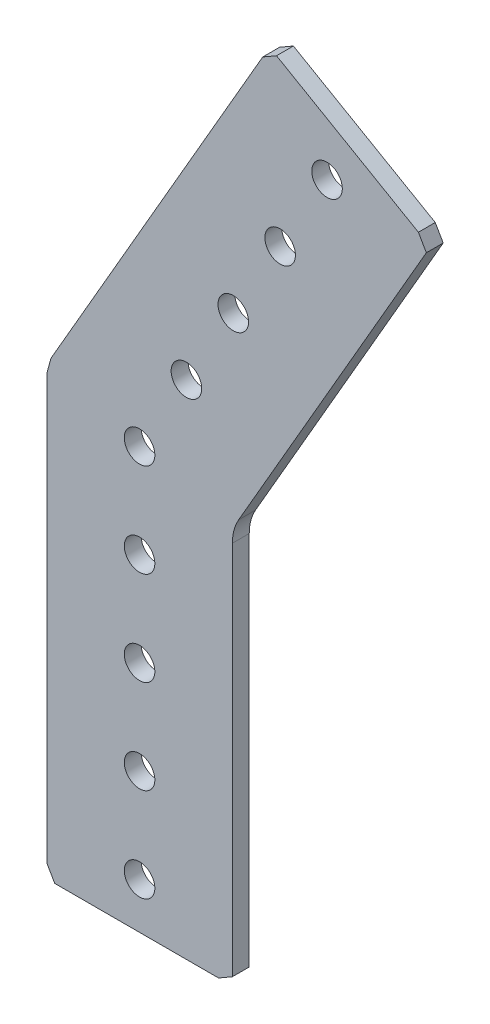
ISO-10303-21;
HEADER;
FILE_DESCRIPTION(('STEP AP214'),'2;1');
FILE_NAME('part.step','',(''),(''),'','','');
FILE_SCHEMA(('AUTOMOTIVE_DESIGN { 1 0 10303 214 1 1 1 1 }'));
ENDSEC;
DATA;
#1=APPLICATION_CONTEXT('core data for automotive mechanical design processes');
#2=APPLICATION_PROTOCOL_DEFINITION('international standard','automotive_design',2000,#1);
#3=PRODUCT_CONTEXT('',#1,'mechanical');
#4=PRODUCT('Part','Part','',(#3));
#5=PRODUCT_RELATED_PRODUCT_CATEGORY('part','',(#4));
#6=PRODUCT_DEFINITION_FORMATION('','',#4);
#7=PRODUCT_DEFINITION_CONTEXT('part definition',#1,'design');
#8=PRODUCT_DEFINITION('design','',#6,#7);
#9=PRODUCT_DEFINITION_SHAPE('','',#8);
#10=(LENGTH_UNIT() NAMED_UNIT(*) SI_UNIT(.MILLI.,.METRE.));
#11=(NAMED_UNIT(*) PLANE_ANGLE_UNIT() SI_UNIT($,.RADIAN.));
#12=(NAMED_UNIT(*) SI_UNIT($,.STERADIAN.) SOLID_ANGLE_UNIT());
#13=UNCERTAINTY_MEASURE_WITH_UNIT(LENGTH_MEASURE(1.E-05),#10,'distance_accuracy_value','');
#14=(GEOMETRIC_REPRESENTATION_CONTEXT(3) GLOBAL_UNCERTAINTY_ASSIGNED_CONTEXT((#13)) GLOBAL_UNIT_ASSIGNED_CONTEXT((#10,
#11,#12)) REPRESENTATION_CONTEXT('',''));
#15=CARTESIAN_POINT('',(0.,0.,0.));
#16=DIRECTION('',(0.,0.,1.));
#17=DIRECTION('',(1.,0.,0.));
#18=AXIS2_PLACEMENT_3D('',#15,#16,#17);
#19=CARTESIAN_POINT('',(0.,0.,2.286));
#20=DIRECTION('',(0.,0.,1.));
#21=DIRECTION('',(1.,0.,0.));
#22=AXIS2_PLACEMENT_3D('',#19,#20,#21);
#23=PLANE('',#22);
#24=DIRECTION('',(0.499999999999995,0.866025403784442,0.));
#25=VECTOR('',#24,1.);
#26=CARTESIAN_POINT('',(17.6229625982179,55.6698666000002,2.286));
#27=LINE('',#26,#25);
#28=CARTESIAN_POINT('',(16.688088174832,54.0506165999989,2.286));
#29=VERTEX_POINT('',#28);
#30=CARTESIAN_POINT('',(-12.0142096816236,4.33677841864198,2.286));
#31=VERTEX_POINT('',#30);
#32=EDGE_CURVE('E217',#29,#31,#27,.F.);
#33=ORIENTED_EDGE('',*,*,#32,.T.);
#34=DIRECTION('',(0.25881904510252,0.965925826289068,0.));
#35=VECTOR('',#34,1.);
#36=CARTESIAN_POINT('',(-12.2936048408118,3.29406148916286,2.286));
#37=LINE('',#36,#35);
#38=CARTESIAN_POINT('',(-12.573,2.25134455968378,2.286));
#39=VERTEX_POINT('',#38);
#40=EDGE_CURVE('E202',#31,#39,#37,.F.);
#41=ORIENTED_EDGE('',*,*,#40,.T.);
#42=DIRECTION('',(0.,1.,0.));
#43=VECTOR('',#42,1.);
#44=CARTESIAN_POINT('',(-12.573,-57.023,2.286));
#45=LINE('',#44,#43);
#46=CARTESIAN_POINT('',(-12.573,-55.1532511532294,2.286));
#47=VERTEX_POINT('',#46);
#48=EDGE_CURVE('E185',#39,#47,#45,.F.);
#49=ORIENTED_EDGE('',*,*,#48,.T.);
#50=DIRECTION('',(-0.500000000000008,0.866025403784434,0.));
#51=VECTOR('',#50,1.);
#52=CARTESIAN_POINT('',(-33.3118083000002,-19.2325814891987,2.286));
#53=LINE('',#52,#51);
#54=CARTESIAN_POINT('',(-11.4935,-57.023,2.286));
#55=VERTEX_POINT('',#54);
#56=EDGE_CURVE('E172',#47,#55,#53,.F.);
#57=ORIENTED_EDGE('',*,*,#56,.T.);
#58=DIRECTION('',(1.,0.,0.));
#59=VECTOR('',#58,1.);
#60=CARTESIAN_POINT('',(12.573,-57.023,2.286));
#61=LINE('',#60,#59);
#62=CARTESIAN_POINT('',(10.7032511532294,-57.023,2.286));
#63=VERTEX_POINT('',#62);
#64=EDGE_CURVE('E177',#55,#63,#61,.T.);
#65=ORIENTED_EDGE('',*,*,#64,.T.);
#66=DIRECTION('',(-0.866025403784434,-0.500000000000008,0.));
#67=VECTOR('',#66,1.);
#68=CARTESIAN_POINT('',(27.3674960883077,-47.4018937008905,2.286));
#69=LINE('',#68,#67);
#70=CARTESIAN_POINT('',(12.573,-55.9435,2.286));
#71=VERTEX_POINT('',#70);
#72=EDGE_CURVE('E161',#63,#71,#69,.F.);
#73=ORIENTED_EDGE('',*,*,#72,.T.);
#74=DIRECTION('',(0.,1.,0.));
#75=VECTOR('',#74,1.);
#76=CARTESIAN_POINT('',(12.573,-3.36892519643647,2.286));
#77=LINE('',#76,#75);
#78=CARTESIAN_POINT('',(12.573,-5.07040256837407,2.286));
#79=VERTEX_POINT('',#78);
#80=EDGE_CURVE('E102',#71,#79,#77,.T.);
#81=ORIENTED_EDGE('',*,*,#80,.T.);
#82=CARTESIAN_POINT('',(18.923,-5.07040256837407,2.286));
#83=DIRECTION('',(0.,0.,1.));
#84=DIRECTION('',(1.,0.,0.));
#85=AXIS2_PLACEMENT_3D('',#82,#83,#84);
#86=CIRCLE('',#85,6.35);
#87=CARTESIAN_POINT('',(13.4237386859688,-1.89540256837411,2.286));
#88=VERTEX_POINT('',#87);
#89=EDGE_CURVE('E105',#79,#88,#86,.F.);
#90=ORIENTED_EDGE('',*,*,#89,.T.);
#91=DIRECTION('',(-0.499999999999995,-0.866025403784442,0.));
#92=VECTOR('',#91,1.);
#93=CARTESIAN_POINT('',(12.573,-3.36892519643646,2.286));
#94=LINE('',#93,#92);
#95=CARTESIAN_POINT('',(38.8602874017805,42.1619921766132,2.286));
#96=VERTEX_POINT('',#95);
#97=EDGE_CURVE('E110',#88,#96,#94,.F.);
#98=ORIENTED_EDGE('',*,*,#97,.T.);
#99=DIRECTION('',(0.499999999999705,-0.866025403784609,0.));
#100=VECTOR('',#99,1.);
#101=CARTESIAN_POINT('',(47.4018937008936,27.3674960882874,2.286));
#102=LINE('',#101,#100);
#103=CARTESIAN_POINT('',(37.7807874017815,44.0317410233852,2.286));
#104=VERTEX_POINT('',#103);
#105=EDGE_CURVE('E123',#96,#104,#102,.F.);
#106=ORIENTED_EDGE('',*,*,#105,.T.);
#107=DIRECTION('',(0.866025403784442,-0.499999999999995,0.));
#108=VECTOR('',#107,1.);
#109=CARTESIAN_POINT('',(39.4000374017815,43.0968666000003,2.286));
#110=LINE('',#109,#108);
#111=CARTESIAN_POINT('',(18.5578370216014,55.1301166000012,2.286));
#112=VERTEX_POINT('',#111);
#113=EDGE_CURVE('E142',#104,#112,#110,.F.);
#114=ORIENTED_EDGE('',*,*,#113,.T.);
#115=DIRECTION('',(0.866025403783796,0.500000000001114,0.));
#116=VECTOR('',#115,1.);
#117=CARTESIAN_POINT('',(-19.232581489214,33.3118082999284,2.286));
#118=LINE('',#117,#116);
#119=EDGE_CURVE('E226',#112,#29,#118,.F.);
#120=ORIENTED_EDGE('',*,*,#119,.T.);
#121=EDGE_LOOP('',(#33,#41,#49,#57,#65,#73,#81,#90,#98,#106,#114,#120));
#122=FACE_BOUND('',#121,.T.);
#123=CARTESIAN_POINT('',(0.,0.,2.286));
#124=DIRECTION('',(0.,0.,-1.));
#125=DIRECTION('',(-1.,0.,0.));
#126=AXIS2_PLACEMENT_3D('',#123,#124,#125);
#127=CIRCLE('',#126,2.0701);
#128=CARTESIAN_POINT('',(-2.0701,0.,2.286));
#129=VERTEX_POINT('',#128);
#130=EDGE_CURVE('E180',#129,#129,#127,.T.);
#131=ORIENTED_EDGE('',*,*,#130,.T.);
#132=EDGE_LOOP('',(#131));
#133=FACE_BOUND('',#132,.T.);
#134=CARTESIAN_POINT('',(3.9907631702977E-13,-38.1,2.286));
#135=DIRECTION('',(0.,0.,-1.));
#136=DIRECTION('',(-1.,0.,0.));
#137=AXIS2_PLACEMENT_3D('',#134,#135,#136);
#138=CIRCLE('',#137,2.0701);
#139=CARTESIAN_POINT('',(-2.0700999999996,-38.1,2.286));
#140=VERTEX_POINT('',#139);
#141=EDGE_CURVE('E287',#140,#140,#138,.T.);
#142=ORIENTED_EDGE('',*,*,#141,.T.);
#143=EDGE_LOOP('',(#142));
#144=FACE_BOUND('',#143,.T.);
#145=CARTESIAN_POINT('',(1.33025439009923E-13,-12.7,2.286));
#146=DIRECTION('',(0.,0.,-1.));
#147=DIRECTION('',(-1.,0.,0.));
#148=AXIS2_PLACEMENT_3D('',#145,#146,#147);
#149=CIRCLE('',#148,2.0701);
#150=CARTESIAN_POINT('',(-2.07009999999987,-12.7,2.286));
#151=VERTEX_POINT('',#150);
#152=EDGE_CURVE('E290',#151,#151,#149,.T.);
#153=ORIENTED_EDGE('',*,*,#152,.T.);
#154=EDGE_LOOP('',(#153));
#155=FACE_BOUND('',#154,.T.);
#156=CARTESIAN_POINT('',(2.66050878019847E-13,-25.4,2.286));
#157=DIRECTION('',(0.,0.,-1.));
#158=DIRECTION('',(-1.,0.,0.));
#159=AXIS2_PLACEMENT_3D('',#156,#157,#158);
#160=CIRCLE('',#159,2.0701);
#161=CARTESIAN_POINT('',(-2.07009999999973,-25.4,2.286));
#162=VERTEX_POINT('',#161);
#163=EDGE_CURVE('E293',#162,#162,#160,.T.);
#164=ORIENTED_EDGE('',*,*,#163,.T.);
#165=EDGE_LOOP('',(#164));
#166=FACE_BOUND('',#165,.T.);
#167=CARTESIAN_POINT('',(0.,-50.8,2.286));
#168=DIRECTION('',(0.,0.,-1.));
#169=DIRECTION('',(-1.,0.,0.));
#170=AXIS2_PLACEMENT_3D('',#167,#168,#169);
#171=CIRCLE('',#170,2.0701);
#172=CARTESIAN_POINT('',(-2.07009999999999,-50.8,2.286));
#173=VERTEX_POINT('',#172);
#174=EDGE_CURVE('E296',#173,#173,#171,.T.);
#175=ORIENTED_EDGE('',*,*,#174,.T.);
#176=EDGE_LOOP('',(#175));
#177=FACE_BOUND('',#176,.T.);
#178=CARTESIAN_POINT('',(19.0500000000001,32.995567884187,2.286));
#179=DIRECTION('',(0.,0.,-1.));
#180=DIRECTION('',(-1.,0.,0.));
#181=AXIS2_PLACEMENT_3D('',#178,#179,#180);
#182=CIRCLE('',#181,2.0701);
#183=CARTESIAN_POINT('',(16.9799000000001,32.995567884187,2.286));
#184=VERTEX_POINT('',#183);
#185=EDGE_CURVE('E299',#184,#184,#182,.T.);
#186=ORIENTED_EDGE('',*,*,#185,.T.);
#187=EDGE_LOOP('',(#186));
#188=FACE_BOUND('',#187,.T.);
#189=CARTESIAN_POINT('',(6.35000000000005,10.9985226280623,2.286));
#190=DIRECTION('',(0.,0.,-1.));
#191=DIRECTION('',(-1.,0.,0.));
#192=AXIS2_PLACEMENT_3D('',#189,#190,#191);
#193=CIRCLE('',#192,2.0701);
#194=CARTESIAN_POINT('',(4.27990000000005,10.9985226280623,2.286));
#195=VERTEX_POINT('',#194);
#196=EDGE_CURVE('E302',#195,#195,#193,.T.);
#197=ORIENTED_EDGE('',*,*,#196,.T.);
#198=EDGE_LOOP('',(#197));
#199=FACE_BOUND('',#198,.T.);
#200=CARTESIAN_POINT('',(12.7000000000001,21.9970452561247,2.286));
#201=DIRECTION('',(0.,0.,-1.));
#202=DIRECTION('',(-1.,0.,0.));
#203=AXIS2_PLACEMENT_3D('',#200,#201,#202);
#204=CIRCLE('',#203,2.0701);
#205=CARTESIAN_POINT('',(10.6299000000001,21.9970452561247,2.286));
#206=VERTEX_POINT('',#205);
#207=EDGE_CURVE('E304',#206,#206,#204,.T.);
#208=ORIENTED_EDGE('',*,*,#207,.T.);
#209=EDGE_LOOP('',(#208));
#210=FACE_BOUND('',#209,.T.);
#211=CARTESIAN_POINT('',(25.3999999999997,43.9940905122496,2.286));
#212=DIRECTION('',(0.,0.,-1.));
#213=DIRECTION('',(-1.,0.,0.));
#214=AXIS2_PLACEMENT_3D('',#211,#212,#213);
#215=CIRCLE('',#214,2.0701);
#216=CARTESIAN_POINT('',(23.3298999999997,43.9940905122496,2.286));
#217=VERTEX_POINT('',#216);
#218=EDGE_CURVE('E20',#217,#217,#215,.T.);
#219=ORIENTED_EDGE('',*,*,#218,.T.);
#220=EDGE_LOOP('',(#219));
#221=FACE_BOUND('',#220,.T.);
#222=ADVANCED_FACE('F17',(#122,#133,#144,#155,#166,#177,#188,#199,#210,#221),#23,.T.);
#223=CARTESIAN_POINT('',(25.3999999999997,43.9940905122496,2.286));
#224=DIRECTION('',(0.,0.,-1.));
#225=DIRECTION('',(-1.,0.,0.));
#226=AXIS2_PLACEMENT_3D('',#223,#224,#225);
#227=CYLINDRICAL_SURFACE('',#226,2.0701);
#228=ORIENTED_EDGE('',*,*,#218,.F.);
#229=EDGE_LOOP('',(#228));
#230=FACE_BOUND('',#229,.T.);
#231=CARTESIAN_POINT('',(25.3999999999997,43.9940905122496,0.));
#232=DIRECTION('',(0.,0.,-1.));
#233=DIRECTION('',(-1.,0.,0.));
#234=AXIS2_PLACEMENT_3D('',#231,#232,#233);
#235=CIRCLE('',#234,2.0701);
#236=CARTESIAN_POINT('',(23.3298999999997,43.9940905122496,0.));
#237=VERTEX_POINT('',#236);
#238=EDGE_CURVE('E194',#237,#237,#235,.T.);
#239=ORIENTED_EDGE('',*,*,#238,.T.);
#240=EDGE_LOOP('',(#239));
#241=FACE_BOUND('',#240,.T.);
#242=ADVANCED_FACE('F312',(#230,#241),#227,.F.);
#243=CARTESIAN_POINT('',(12.7000000000001,21.9970452561247,2.286));
#244=DIRECTION('',(0.,0.,-1.));
#245=DIRECTION('',(-1.,0.,0.));
#246=AXIS2_PLACEMENT_3D('',#243,#244,#245);
#247=CYLINDRICAL_SURFACE('',#246,2.0701);
#248=ORIENTED_EDGE('',*,*,#207,.F.);
#249=EDGE_LOOP('',(#248));
#250=FACE_BOUND('',#249,.T.);
#251=CARTESIAN_POINT('',(12.7000000000001,21.9970452561247,0.));
#252=DIRECTION('',(0.,0.,-1.));
#253=DIRECTION('',(-1.,0.,0.));
#254=AXIS2_PLACEMENT_3D('',#251,#252,#253);
#255=CIRCLE('',#254,2.0701);
#256=CARTESIAN_POINT('',(10.6299000000001,21.9970452561247,0.));
#257=VERTEX_POINT('',#256);
#258=EDGE_CURVE('E280',#257,#257,#255,.T.);
#259=ORIENTED_EDGE('',*,*,#258,.T.);
#260=EDGE_LOOP('',(#259));
#261=FACE_BOUND('',#260,.T.);
#262=ADVANCED_FACE('F315',(#250,#261),#247,.F.);
#263=CARTESIAN_POINT('',(6.35000000000005,10.9985226280623,2.286));
#264=DIRECTION('',(0.,0.,-1.));
#265=DIRECTION('',(-1.,0.,0.));
#266=AXIS2_PLACEMENT_3D('',#263,#264,#265);
#267=CYLINDRICAL_SURFACE('',#266,2.0701);
#268=ORIENTED_EDGE('',*,*,#196,.F.);
#269=EDGE_LOOP('',(#268));
#270=FACE_BOUND('',#269,.T.);
#271=CARTESIAN_POINT('',(6.35000000000005,10.9985226280623,0.));
#272=DIRECTION('',(0.,0.,-1.));
#273=DIRECTION('',(-1.,0.,0.));
#274=AXIS2_PLACEMENT_3D('',#271,#272,#273);
#275=CIRCLE('',#274,2.0701);
#276=CARTESIAN_POINT('',(4.27990000000005,10.9985226280623,0.));
#277=VERTEX_POINT('',#276);
#278=EDGE_CURVE('E277',#277,#277,#275,.T.);
#279=ORIENTED_EDGE('',*,*,#278,.T.);
#280=EDGE_LOOP('',(#279));
#281=FACE_BOUND('',#280,.T.);
#282=ADVANCED_FACE('F394',(#270,#281),#267,.F.);
#283=CARTESIAN_POINT('',(19.0500000000001,32.995567884187,2.286));
#284=DIRECTION('',(0.,0.,-1.));
#285=DIRECTION('',(-1.,0.,0.));
#286=AXIS2_PLACEMENT_3D('',#283,#284,#285);
#287=CYLINDRICAL_SURFACE('',#286,2.0701);
#288=ORIENTED_EDGE('',*,*,#185,.F.);
#289=EDGE_LOOP('',(#288));
#290=FACE_BOUND('',#289,.T.);
#291=CARTESIAN_POINT('',(19.0500000000001,32.995567884187,0.));
#292=DIRECTION('',(0.,0.,-1.));
#293=DIRECTION('',(-1.,0.,0.));
#294=AXIS2_PLACEMENT_3D('',#291,#292,#293);
#295=CIRCLE('',#294,2.0701);
#296=CARTESIAN_POINT('',(16.9799000000001,32.995567884187,0.));
#297=VERTEX_POINT('',#296);
#298=EDGE_CURVE('E274',#297,#297,#295,.T.);
#299=ORIENTED_EDGE('',*,*,#298,.T.);
#300=EDGE_LOOP('',(#299));
#301=FACE_BOUND('',#300,.T.);
#302=ADVANCED_FACE('F390',(#290,#301),#287,.F.);
#303=CARTESIAN_POINT('',(0.,-50.8,2.286));
#304=DIRECTION('',(0.,0.,-1.));
#305=DIRECTION('',(-1.,0.,0.));
#306=AXIS2_PLACEMENT_3D('',#303,#304,#305);
#307=CYLINDRICAL_SURFACE('',#306,2.0701);
#308=CARTESIAN_POINT('',(0.,-50.8,0.));
#309=DIRECTION('',(0.,0.,-1.));
#310=DIRECTION('',(-1.,0.,0.));
#311=AXIS2_PLACEMENT_3D('',#308,#309,#310);
#312=CIRCLE('',#311,2.0701);
#313=CARTESIAN_POINT('',(-2.07009999999999,-50.8,0.));
#314=VERTEX_POINT('',#313);
#315=EDGE_CURVE('E271',#314,#314,#312,.T.);
#316=ORIENTED_EDGE('',*,*,#315,.T.);
#317=EDGE_LOOP('',(#316));
#318=FACE_BOUND('',#317,.T.);
#319=ORIENTED_EDGE('',*,*,#174,.F.);
#320=EDGE_LOOP('',(#319));
#321=FACE_BOUND('',#320,.T.);
#322=ADVANCED_FACE('F386',(#318,#321),#307,.F.);
#323=CARTESIAN_POINT('',(2.66050878019847E-13,-25.4,2.286));
#324=DIRECTION('',(0.,0.,-1.));
#325=DIRECTION('',(-1.,0.,0.));
#326=AXIS2_PLACEMENT_3D('',#323,#324,#325);
#327=CYLINDRICAL_SURFACE('',#326,2.0701);
#328=CARTESIAN_POINT('',(2.66050878019847E-13,-25.4,0.));
#329=DIRECTION('',(0.,0.,-1.));
#330=DIRECTION('',(-1.,0.,0.));
#331=AXIS2_PLACEMENT_3D('',#328,#329,#330);
#332=CIRCLE('',#331,2.0701);
#333=CARTESIAN_POINT('',(-2.07009999999973,-25.4,0.));
#334=VERTEX_POINT('',#333);
#335=EDGE_CURVE('E268',#334,#334,#332,.T.);
#336=ORIENTED_EDGE('',*,*,#335,.T.);
#337=EDGE_LOOP('',(#336));
#338=FACE_BOUND('',#337,.T.);
#339=ORIENTED_EDGE('',*,*,#163,.F.);
#340=EDGE_LOOP('',(#339));
#341=FACE_BOUND('',#340,.T.);
#342=ADVANCED_FACE('F382',(#338,#341),#327,.F.);
#343=CARTESIAN_POINT('',(1.33025439009923E-13,-12.7,2.286));
#344=DIRECTION('',(0.,0.,-1.));
#345=DIRECTION('',(-1.,0.,0.));
#346=AXIS2_PLACEMENT_3D('',#343,#344,#345);
#347=CYLINDRICAL_SURFACE('',#346,2.0701);
#348=CARTESIAN_POINT('',(1.33025439009923E-13,-12.7,0.));
#349=DIRECTION('',(0.,0.,-1.));
#350=DIRECTION('',(-1.,0.,0.));
#351=AXIS2_PLACEMENT_3D('',#348,#349,#350);
#352=CIRCLE('',#351,2.0701);
#353=CARTESIAN_POINT('',(-2.07009999999987,-12.7,0.));
#354=VERTEX_POINT('',#353);
#355=EDGE_CURVE('E265',#354,#354,#352,.T.);
#356=ORIENTED_EDGE('',*,*,#355,.T.);
#357=EDGE_LOOP('',(#356));
#358=FACE_BOUND('',#357,.T.);
#359=ORIENTED_EDGE('',*,*,#152,.F.);
#360=EDGE_LOOP('',(#359));
#361=FACE_BOUND('',#360,.T.);
#362=ADVANCED_FACE('F378',(#358,#361),#347,.F.);
#363=CARTESIAN_POINT('',(3.9907631702977E-13,-38.1,2.286));
#364=DIRECTION('',(0.,0.,-1.));
#365=DIRECTION('',(-1.,0.,0.));
#366=AXIS2_PLACEMENT_3D('',#363,#364,#365);
#367=CYLINDRICAL_SURFACE('',#366,2.0701);
#368=CARTESIAN_POINT('',(3.9907631702977E-13,-38.1,0.));
#369=DIRECTION('',(0.,0.,-1.));
#370=DIRECTION('',(-1.,0.,0.));
#371=AXIS2_PLACEMENT_3D('',#368,#369,#370);
#372=CIRCLE('',#371,2.0701);
#373=CARTESIAN_POINT('',(-2.0700999999996,-38.1,0.));
#374=VERTEX_POINT('',#373);
#375=EDGE_CURVE('E262',#374,#374,#372,.T.);
#376=ORIENTED_EDGE('',*,*,#375,.T.);
#377=EDGE_LOOP('',(#376));
#378=FACE_BOUND('',#377,.T.);
#379=ORIENTED_EDGE('',*,*,#141,.F.);
#380=EDGE_LOOP('',(#379));
#381=FACE_BOUND('',#380,.T.);
#382=ADVANCED_FACE('F374',(#378,#381),#367,.F.);
#383=CARTESIAN_POINT('',(0.,0.,2.286));
#384=DIRECTION('',(0.,0.,-1.));
#385=DIRECTION('',(-1.,0.,0.));
#386=AXIS2_PLACEMENT_3D('',#383,#384,#385);
#387=CYLINDRICAL_SURFACE('',#386,2.0701);
#388=ORIENTED_EDGE('',*,*,#130,.F.);
#389=EDGE_LOOP('',(#388));
#390=FACE_BOUND('',#389,.T.);
#391=CARTESIAN_POINT('',(0.,0.,0.));
#392=DIRECTION('',(0.,0.,-1.));
#393=DIRECTION('',(-1.,0.,0.));
#394=AXIS2_PLACEMENT_3D('',#391,#392,#393);
#395=CIRCLE('',#394,2.0701);
#396=CARTESIAN_POINT('',(-2.0701,0.,0.));
#397=VERTEX_POINT('',#396);
#398=EDGE_CURVE('E166',#397,#397,#395,.T.);
#399=ORIENTED_EDGE('',*,*,#398,.T.);
#400=EDGE_LOOP('',(#399));
#401=FACE_BOUND('',#400,.T.);
#402=ADVANCED_FACE('F370',(#390,#401),#387,.F.);
#403=CARTESIAN_POINT('',(12.573,-57.023,2.286));
#404=DIRECTION('',(0.,1.,0.));
#405=DIRECTION('',(0.,0.,1.));
#406=AXIS2_PLACEMENT_3D('',#403,#404,#405);
#407=PLANE('',#406);
#408=DIRECTION('',(1.,0.,0.));
#409=VECTOR('',#408,1.);
#410=CARTESIAN_POINT('',(0.,-57.023,0.));
#411=LINE('',#410,#409);
#412=CARTESIAN_POINT('',(-11.4935,-57.023,0.));
#413=VERTEX_POINT('',#412);
#414=CARTESIAN_POINT('',(10.7032511532294,-57.023,0.));
#415=VERTEX_POINT('',#414);
#416=EDGE_CURVE('E155',#413,#415,#411,.T.);
#417=ORIENTED_EDGE('',*,*,#416,.T.);
#418=DIRECTION('',(0.,0.,1.));
#419=VECTOR('',#418,1.);
#420=CARTESIAN_POINT('',(10.7032511532294,-57.023,0.));
#421=LINE('',#420,#419);
#422=EDGE_CURVE('E158',#415,#63,#421,.T.);
#423=ORIENTED_EDGE('',*,*,#422,.T.);
#424=ORIENTED_EDGE('',*,*,#64,.F.);
#425=DIRECTION('',(0.,0.,1.));
#426=VECTOR('',#425,1.);
#427=CARTESIAN_POINT('',(-11.4935,-57.023,0.));
#428=LINE('',#427,#426);
#429=EDGE_CURVE('E169',#55,#413,#428,.F.);
#430=ORIENTED_EDGE('',*,*,#429,.T.);
#431=EDGE_LOOP('',(#417,#423,#424,#430));
#432=FACE_BOUND('',#431,.T.);
#433=ADVANCED_FACE('F366',(#432),#407,.F.);
#434=CARTESIAN_POINT('',(27.3674960883077,-47.4018937008905,0.));
#435=DIRECTION('',(-0.500000000000008,0.866025403784434,0.));
#436=DIRECTION('',(-0.866025403784434,-0.500000000000008,0.));
#437=AXIS2_PLACEMENT_3D('',#434,#435,#436);
#438=PLANE('',#437);
#439=DIRECTION('',(0.866025403784434,0.500000000000008,0.));
#440=VECTOR('',#439,1.);
#441=CARTESIAN_POINT('',(10.7032511532294,-57.023,0.));
#442=LINE('',#441,#440);
#443=CARTESIAN_POINT('',(12.573,-55.9435,0.));
#444=VERTEX_POINT('',#443);
#445=EDGE_CURVE('E151',#415,#444,#442,.T.);
#446=ORIENTED_EDGE('',*,*,#445,.T.);
#447=DIRECTION('',(0.,0.,1.));
#448=VECTOR('',#447,1.);
#449=CARTESIAN_POINT('',(12.573,-55.9435,2.286));
#450=LINE('',#449,#448);
#451=EDGE_CURVE('E146',#444,#71,#450,.T.);
#452=ORIENTED_EDGE('',*,*,#451,.T.);
#453=ORIENTED_EDGE('',*,*,#72,.F.);
#454=ORIENTED_EDGE('',*,*,#422,.F.);
#455=EDGE_LOOP('',(#446,#452,#453,#454));
#456=FACE_BOUND('',#455,.T.);
#457=ADVANCED_FACE('F362',(#456),#438,.F.);
#458=CARTESIAN_POINT('',(12.573,-3.36892519643647,2.286));
#459=DIRECTION('',(-1.,0.,0.));
#460=DIRECTION('',(0.,0.,1.));
#461=AXIS2_PLACEMENT_3D('',#458,#459,#460);
#462=PLANE('',#461);
#463=DIRECTION('',(0.,1.,0.));
#464=VECTOR('',#463,1.);
#465=CARTESIAN_POINT('',(12.573,0.,0.));
#466=LINE('',#465,#464);
#467=CARTESIAN_POINT('',(12.573,-5.07040256837407,0.));
#468=VERTEX_POINT('',#467);
#469=EDGE_CURVE('E154',#444,#468,#466,.T.);
#470=ORIENTED_EDGE('',*,*,#469,.T.);
#471=DIRECTION('',(0.,0.,1.));
#472=VECTOR('',#471,1.);
#473=CARTESIAN_POINT('',(12.573,-5.07040256837407,2.286));
#474=LINE('',#473,#472);
#475=EDGE_CURVE('E116',#468,#79,#474,.T.);
#476=ORIENTED_EDGE('',*,*,#475,.T.);
#477=ORIENTED_EDGE('',*,*,#80,.F.);
#478=ORIENTED_EDGE('',*,*,#451,.F.);
#479=EDGE_LOOP('',(#470,#476,#477,#478));
#480=FACE_BOUND('',#479,.T.);
#481=ADVANCED_FACE('F359',(#480),#462,.F.);
#482=CARTESIAN_POINT('',(18.923,-5.07040256837407,2.286));
#483=DIRECTION('',(0.,0.,1.));
#484=DIRECTION('',(1.,0.,0.));
#485=AXIS2_PLACEMENT_3D('',#482,#483,#484);
#486=CYLINDRICAL_SURFACE('',#485,6.35);
#487=ORIENTED_EDGE('',*,*,#475,.F.);
#488=CARTESIAN_POINT('',(18.923,-5.07040256837407,0.));
#489=DIRECTION('',(0.,0.,1.));
#490=DIRECTION('',(1.,0.,0.));
#491=AXIS2_PLACEMENT_3D('',#488,#489,#490);
#492=CIRCLE('',#491,6.35);
#493=CARTESIAN_POINT('',(13.4237386859688,-1.89540256837411,0.));
#494=VERTEX_POINT('',#493);
#495=EDGE_CURVE('E128',#468,#494,#492,.F.);
#496=ORIENTED_EDGE('',*,*,#495,.T.);
#497=DIRECTION('',(0.,0.,1.));
#498=VECTOR('',#497,1.);
#499=CARTESIAN_POINT('',(13.4237386859688,-1.8954025683741,2.286));
#500=LINE('',#499,#498);
#501=EDGE_CURVE('E115',#494,#88,#500,.T.);
#502=ORIENTED_EDGE('',*,*,#501,.T.);
#503=ORIENTED_EDGE('',*,*,#89,.F.);
#504=EDGE_LOOP('',(#487,#496,#502,#503));
#505=FACE_BOUND('',#504,.T.);
#506=ADVANCED_FACE('F126',(#505),#486,.F.);
#507=CARTESIAN_POINT('',(12.573,-3.36892519643646,2.286));
#508=DIRECTION('',(-0.866025403784442,0.499999999999995,0.));
#509=DIRECTION('',(-0.499999999999995,-0.866025403784442,0.));
#510=AXIS2_PLACEMENT_3D('',#507,#508,#509);
#511=PLANE('',#510);
#512=ORIENTED_EDGE('',*,*,#97,.F.);
#513=ORIENTED_EDGE('',*,*,#501,.F.);
#514=DIRECTION('',(0.499999999999994,0.866025403784442,0.));
#515=VECTOR('',#514,1.);
#516=CARTESIAN_POINT('',(13.4237386859688,-1.89540256837411,0.));
#517=LINE('',#516,#515);
#518=CARTESIAN_POINT('',(38.8602874017805,42.1619921766132,0.));
#519=VERTEX_POINT('',#518);
#520=EDGE_CURVE('E138',#494,#519,#517,.T.);
#521=ORIENTED_EDGE('',*,*,#520,.T.);
#522=DIRECTION('',(0.,0.,1.));
#523=VECTOR('',#522,1.);
#524=CARTESIAN_POINT('',(38.8602874017805,42.1619921766132,0.));
#525=LINE('',#524,#523);
#526=EDGE_CURVE('E122',#519,#96,#525,.T.);
#527=ORIENTED_EDGE('',*,*,#526,.T.);
#528=EDGE_LOOP('',(#512,#513,#521,#527));
#529=FACE_BOUND('',#528,.T.);
#530=ADVANCED_FACE('F119',(#529),#511,.F.);
#531=CARTESIAN_POINT('',(47.4018937008936,27.3674960882874,0.));
#532=DIRECTION('',(-0.866025403784609,-0.499999999999705,0.));
#533=DIRECTION('',(0.499999999999705,-0.866025403784609,0.));
#534=AXIS2_PLACEMENT_3D('',#531,#532,#533);
#535=PLANE('',#534);
#536=DIRECTION('',(-0.499999999999701,0.866025403784611,0.));
#537=VECTOR('',#536,1.);
#538=CARTESIAN_POINT('',(38.8602874017805,42.1619921766132,0.));
#539=LINE('',#538,#537);
#540=CARTESIAN_POINT('',(37.7807874017813,44.0317410233845,0.));
#541=VERTEX_POINT('',#540);
#542=EDGE_CURVE('E134',#519,#541,#539,.T.);
#543=ORIENTED_EDGE('',*,*,#542,.T.);
#544=DIRECTION('',(0.,0.,1.));
#545=VECTOR('',#544,1.);
#546=CARTESIAN_POINT('',(37.7807874017818,44.0317410233854,2.286));
#547=LINE('',#546,#545);
#548=EDGE_CURVE('E229',#541,#104,#547,.T.);
#549=ORIENTED_EDGE('',*,*,#548,.T.);
#550=ORIENTED_EDGE('',*,*,#105,.F.);
#551=ORIENTED_EDGE('',*,*,#526,.F.);
#552=EDGE_LOOP('',(#543,#549,#550,#551));
#553=FACE_BOUND('',#552,.T.);
#554=ADVANCED_FACE('F350',(#553),#535,.F.);
#555=CARTESIAN_POINT('',(39.4000374017815,43.0968666000003,2.286));
#556=DIRECTION('',(-0.499999999999995,-0.866025403784442,0.));
#557=DIRECTION('',(0.866025403784442,-0.499999999999995,0.));
#558=AXIS2_PLACEMENT_3D('',#555,#556,#557);
#559=PLANE('',#558);
#560=DIRECTION('',(-0.866025403784411,0.500000000000048,0.));
#561=VECTOR('',#560,1.);
#562=CARTESIAN_POINT('',(37.7807874017811,44.0317410233842,0.));
#563=LINE('',#562,#561);
#564=CARTESIAN_POINT('',(18.5578370216014,55.1301166000012,0.));
#565=VERTEX_POINT('',#564);
#566=EDGE_CURVE('E137',#541,#565,#563,.T.);
#567=ORIENTED_EDGE('',*,*,#566,.T.);
#568=DIRECTION('',(0.,0.,1.));
#569=VECTOR('',#568,1.);
#570=CARTESIAN_POINT('',(18.5578370216014,55.1301166000012,0.));
#571=LINE('',#570,#569);
#572=EDGE_CURVE('E219',#565,#112,#571,.T.);
#573=ORIENTED_EDGE('',*,*,#572,.T.);
#574=ORIENTED_EDGE('',*,*,#113,.F.);
#575=ORIENTED_EDGE('',*,*,#548,.F.);
#576=EDGE_LOOP('',(#567,#573,#574,#575));
#577=FACE_BOUND('',#576,.T.);
#578=ADVANCED_FACE('F346',(#577),#559,.F.);
#579=CARTESIAN_POINT('',(-19.232581489214,33.3118082999284,0.));
#580=DIRECTION('',(0.500000000001114,-0.866025403783796,0.));
#581=DIRECTION('',(0.866025403783796,0.500000000001114,0.));
#582=AXIS2_PLACEMENT_3D('',#579,#580,#581);
#583=PLANE('',#582);
#584=DIRECTION('',(-0.866025403783792,-0.500000000001121,0.));
#585=VECTOR('',#584,1.);
#586=CARTESIAN_POINT('',(18.5578370216014,55.1301166000012,0.));
#587=LINE('',#586,#585);
#588=CARTESIAN_POINT('',(16.6880881748322,54.0506165999988,0.));
#589=VERTEX_POINT('',#588);
#590=EDGE_CURVE('E594',#565,#589,#587,.T.);
#591=ORIENTED_EDGE('',*,*,#590,.T.);
#592=DIRECTION('',(0.,0.,1.));
#593=VECTOR('',#592,1.);
#594=CARTESIAN_POINT('',(16.6880881748319,54.050616599999,2.286));
#595=LINE('',#594,#593);
#596=EDGE_CURVE('E204',#589,#29,#595,.T.);
#597=ORIENTED_EDGE('',*,*,#596,.T.);
#598=ORIENTED_EDGE('',*,*,#119,.F.);
#599=ORIENTED_EDGE('',*,*,#572,.F.);
#600=EDGE_LOOP('',(#591,#597,#598,#599));
#601=FACE_BOUND('',#600,.T.);
#602=ADVANCED_FACE('F342',(#601),#583,.F.);
#603=CARTESIAN_POINT('',(17.6229625982179,55.6698666000002,2.286));
#604=DIRECTION('',(0.866025403784442,-0.499999999999995,0.));
#605=DIRECTION('',(0.499999999999995,0.866025403784442,0.));
#606=AXIS2_PLACEMENT_3D('',#603,#604,#605);
#607=PLANE('',#606);
#608=DIRECTION('',(-0.5,-0.866025403784439,0.));
#609=VECTOR('',#608,1.);
#610=CARTESIAN_POINT('',(16.6880881748322,54.0506165999988,0.));
#611=LINE('',#610,#609);
#612=CARTESIAN_POINT('',(-12.0142096816236,4.33677841864197,0.));
#613=VERTEX_POINT('',#612);
#614=EDGE_CURVE('E214',#589,#613,#611,.T.);
#615=ORIENTED_EDGE('',*,*,#614,.T.);
#616=DIRECTION('',(0.,0.,1.));
#617=VECTOR('',#616,1.);
#618=CARTESIAN_POINT('',(-12.0142096816236,4.33677841864198,0.));
#619=LINE('',#618,#617);
#620=EDGE_CURVE('E199',#613,#31,#619,.T.);
#621=ORIENTED_EDGE('',*,*,#620,.T.);
#622=ORIENTED_EDGE('',*,*,#32,.F.);
#623=ORIENTED_EDGE('',*,*,#596,.F.);
#624=EDGE_LOOP('',(#615,#621,#622,#623));
#625=FACE_BOUND('',#624,.T.);
#626=ADVANCED_FACE('F338',(#625),#607,.F.);
#627=CARTESIAN_POINT('',(-12.2936048408118,3.29406148916286,0.));
#628=DIRECTION('',(0.965925826289068,-0.25881904510252,0.));
#629=DIRECTION('',(0.25881904510252,0.965925826289068,0.));
#630=AXIS2_PLACEMENT_3D('',#627,#628,#629);
#631=PLANE('',#630);
#632=DIRECTION('',(-0.25881904510253,-0.965925826289066,0.));
#633=VECTOR('',#632,1.);
#634=CARTESIAN_POINT('',(-12.0142096816236,4.33677841864198,0.));
#635=LINE('',#634,#633);
#636=CARTESIAN_POINT('',(-12.573,2.25134455968378,0.));
#637=VERTEX_POINT('',#636);
#638=EDGE_CURVE('E209',#613,#637,#635,.T.);
#639=ORIENTED_EDGE('',*,*,#638,.T.);
#640=DIRECTION('',(0.,0.,-1.));
#641=VECTOR('',#640,1.);
#642=CARTESIAN_POINT('',(-12.573,2.25134455968378,2.286));
#643=LINE('',#642,#641);
#644=EDGE_CURVE('E190',#637,#39,#643,.F.);
#645=ORIENTED_EDGE('',*,*,#644,.T.);
#646=ORIENTED_EDGE('',*,*,#40,.F.);
#647=ORIENTED_EDGE('',*,*,#620,.F.);
#648=EDGE_LOOP('',(#639,#645,#646,#647));
#649=FACE_BOUND('',#648,.T.);
#650=ADVANCED_FACE('F334',(#649),#631,.F.);
#651=CARTESIAN_POINT('',(-12.573,-57.023,2.286));
#652=DIRECTION('',(1.,0.,0.));
#653=DIRECTION('',(0.,0.,-1.));
#654=AXIS2_PLACEMENT_3D('',#651,#652,#653);
#655=PLANE('',#654);
#656=ORIENTED_EDGE('',*,*,#48,.F.);
#657=ORIENTED_EDGE('',*,*,#644,.F.);
#658=DIRECTION('',(0.,1.,0.));
#659=VECTOR('',#658,1.);
#660=CARTESIAN_POINT('',(-12.573,0.,0.));
#661=LINE('',#660,#659);
#662=CARTESIAN_POINT('',(-12.573,-55.1532511532294,0.));
#663=VERTEX_POINT('',#662);
#664=EDGE_CURVE('E26',#637,#663,#661,.F.);
#665=ORIENTED_EDGE('',*,*,#664,.T.);
#666=DIRECTION('',(0.,0.,1.));
#667=VECTOR('',#666,1.);
#668=CARTESIAN_POINT('',(-12.573,-55.1532511532294,0.));
#669=LINE('',#668,#667);
#670=EDGE_CURVE('E34',#663,#47,#669,.T.);
#671=ORIENTED_EDGE('',*,*,#670,.T.);
#672=EDGE_LOOP('',(#656,#657,#665,#671));
#673=FACE_BOUND('',#672,.T.);
#674=ADVANCED_FACE('F327',(#673),#655,.F.);
#675=CARTESIAN_POINT('',(-33.3118083000002,-19.2325814891987,0.));
#676=DIRECTION('',(0.866025403784434,0.500000000000008,0.));
#677=DIRECTION('',(-0.500000000000008,0.866025403784434,0.));
#678=AXIS2_PLACEMENT_3D('',#675,#676,#677);
#679=PLANE('',#678);
#680=DIRECTION('',(0.500000000000008,-0.866025403784434,0.));
#681=VECTOR('',#680,1.);
#682=CARTESIAN_POINT('',(-12.573,-55.1532511532294,0.));
#683=LINE('',#682,#681);
#684=EDGE_CURVE('E10',#663,#413,#683,.T.);
#685=ORIENTED_EDGE('',*,*,#684,.T.);
#686=ORIENTED_EDGE('',*,*,#429,.F.);
#687=ORIENTED_EDGE('',*,*,#56,.F.);
#688=ORIENTED_EDGE('',*,*,#670,.F.);
#689=EDGE_LOOP('',(#685,#686,#687,#688));
#690=FACE_BOUND('',#689,.T.);
#691=ADVANCED_FACE('F320',(#690),#679,.F.);
#692=CARTESIAN_POINT('',(0.,0.,0.));
#693=DIRECTION('',(0.,0.,1.));
#694=DIRECTION('',(1.,0.,0.));
#695=AXIS2_PLACEMENT_3D('',#692,#693,#694);
#696=PLANE('',#695);
#697=ORIENTED_EDGE('',*,*,#664,.F.);
#698=ORIENTED_EDGE('',*,*,#638,.F.);
#699=ORIENTED_EDGE('',*,*,#614,.F.);
#700=ORIENTED_EDGE('',*,*,#590,.F.);
#701=ORIENTED_EDGE('',*,*,#566,.F.);
#702=ORIENTED_EDGE('',*,*,#542,.F.);
#703=ORIENTED_EDGE('',*,*,#520,.F.);
#704=ORIENTED_EDGE('',*,*,#495,.F.);
#705=ORIENTED_EDGE('',*,*,#469,.F.);
#706=ORIENTED_EDGE('',*,*,#445,.F.);
#707=ORIENTED_EDGE('',*,*,#416,.F.);
#708=ORIENTED_EDGE('',*,*,#684,.F.);
#709=EDGE_LOOP('',(#697,#698,#699,#700,#701,#702,#703,#704,#705,#706,#707,#708));
#710=FACE_BOUND('',#709,.T.);
#711=ORIENTED_EDGE('',*,*,#398,.F.);
#712=EDGE_LOOP('',(#711));
#713=FACE_BOUND('',#712,.T.);
#714=ORIENTED_EDGE('',*,*,#375,.F.);
#715=EDGE_LOOP('',(#714));
#716=FACE_BOUND('',#715,.T.);
#717=ORIENTED_EDGE('',*,*,#355,.F.);
#718=EDGE_LOOP('',(#717));
#719=FACE_BOUND('',#718,.T.);
#720=ORIENTED_EDGE('',*,*,#335,.F.);
#721=EDGE_LOOP('',(#720));
#722=FACE_BOUND('',#721,.T.);
#723=ORIENTED_EDGE('',*,*,#315,.F.);
#724=EDGE_LOOP('',(#723));
#725=FACE_BOUND('',#724,.T.);
#726=ORIENTED_EDGE('',*,*,#298,.F.);
#727=EDGE_LOOP('',(#726));
#728=FACE_BOUND('',#727,.T.);
#729=ORIENTED_EDGE('',*,*,#278,.F.);
#730=EDGE_LOOP('',(#729));
#731=FACE_BOUND('',#730,.T.);
#732=ORIENTED_EDGE('',*,*,#258,.F.);
#733=EDGE_LOOP('',(#732));
#734=FACE_BOUND('',#733,.T.);
#735=ORIENTED_EDGE('',*,*,#238,.F.);
#736=EDGE_LOOP('',(#735));
#737=FACE_BOUND('',#736,.T.);
#738=ADVANCED_FACE('F318',(#710,#713,#716,#719,#722,#725,#728,#731,#734,#737),#696,.F.);
#739=CLOSED_SHELL('',(#222,#242,#262,#282,#302,#322,#342,#362,#382,#402,#433,#457,#481,#506,
#530,#554,#578,#602,#626,#650,#674,#691,#738));
#740=MANIFOLD_SOLID_BREP('B1',#739);
#741=ADVANCED_BREP_SHAPE_REPRESENTATION('',(#18,#740),#14);
#742=SHAPE_DEFINITION_REPRESENTATION(#9,#741);
ENDSEC;
END-ISO-10303-21;
